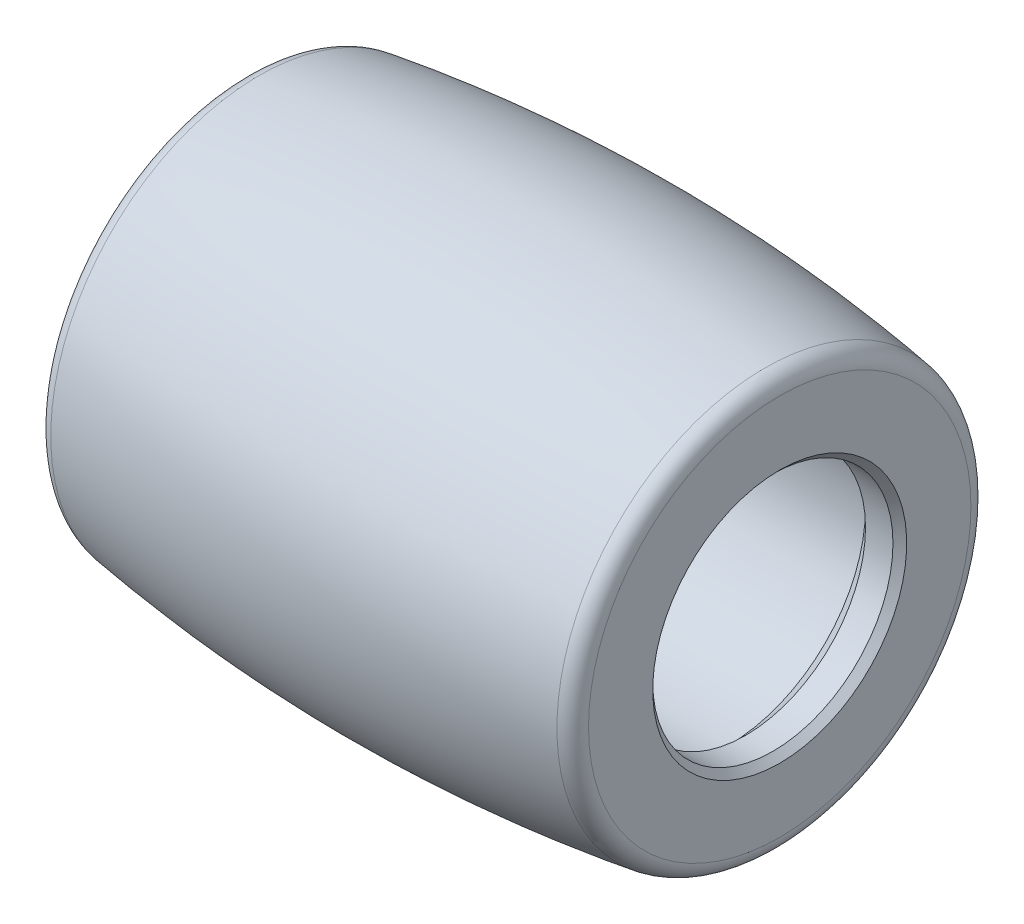
ISO-10303-21;
HEADER;
FILE_DESCRIPTION(('STEP AP214'),'2;1');
FILE_NAME('part.step','',(''),(''),'','','');
FILE_SCHEMA(('AUTOMOTIVE_DESIGN { 1 0 10303 214 1 1 1 1 }'));
ENDSEC;
DATA;
#1=APPLICATION_CONTEXT('core data for automotive mechanical design processes');
#2=APPLICATION_PROTOCOL_DEFINITION('international standard','automotive_design',2000,#1);
#3=PRODUCT_CONTEXT('',#1,'mechanical');
#4=PRODUCT('Part','Part','',(#3));
#5=PRODUCT_RELATED_PRODUCT_CATEGORY('part','',(#4));
#6=PRODUCT_DEFINITION_FORMATION('','',#4);
#7=PRODUCT_DEFINITION_CONTEXT('part definition',#1,'design');
#8=PRODUCT_DEFINITION('design','',#6,#7);
#9=PRODUCT_DEFINITION_SHAPE('','',#8);
#10=(LENGTH_UNIT() NAMED_UNIT(*) SI_UNIT(.MILLI.,.METRE.));
#11=(NAMED_UNIT(*) PLANE_ANGLE_UNIT() SI_UNIT($,.RADIAN.));
#12=(NAMED_UNIT(*) SI_UNIT($,.STERADIAN.) SOLID_ANGLE_UNIT());
#13=UNCERTAINTY_MEASURE_WITH_UNIT(LENGTH_MEASURE(1.E-05),#10,'distance_accuracy_value','');
#14=(GEOMETRIC_REPRESENTATION_CONTEXT(3) GLOBAL_UNCERTAINTY_ASSIGNED_CONTEXT((#13)) GLOBAL_UNIT_ASSIGNED_CONTEXT((#10,
#11,#12)) REPRESENTATION_CONTEXT('',''));
#15=CARTESIAN_POINT('',(0.,0.,0.));
#16=DIRECTION('',(0.,0.,1.));
#17=DIRECTION('',(1.,0.,0.));
#18=AXIS2_PLACEMENT_3D('',#15,#16,#17);
#19=CARTESIAN_POINT('',(-7.8,0.,0.));
#20=DIRECTION('',(-1.,0.,0.));
#21=DIRECTION('',(0.,0.,1.));
#22=AXIS2_PLACEMENT_3D('',#19,#20,#21);
#23=CYLINDRICAL_SURFACE('',#22,4.);
#24=CARTESIAN_POINT('',(-6.30000000012387,0.,0.));
#25=DIRECTION('',(1.,0.,0.));
#26=DIRECTION('',(0.,0.,-1.));
#27=AXIS2_PLACEMENT_3D('',#24,#25,#26);
#28=CIRCLE('',#27,3.99999999996226);
#29=CARTESIAN_POINT('',(-6.30000000012387,0.,-3.99999999996226));
#30=VERTEX_POINT('',#29);
#31=EDGE_CURVE('E47',#30,#30,#28,.F.);
#32=ORIENTED_EDGE('',*,*,#31,.T.);
#33=EDGE_LOOP('',(#32));
#34=FACE_BOUND('',#33,.T.);
#35=CARTESIAN_POINT('',(6.30000000012387,0.,0.));
#36=DIRECTION('',(-1.,0.,0.));
#37=DIRECTION('',(0.,0.,1.));
#38=AXIS2_PLACEMENT_3D('',#35,#36,#37);
#39=CIRCLE('',#38,3.99999999996226);
#40=CARTESIAN_POINT('',(6.30000000012387,0.,3.99999999996226));
#41=VERTEX_POINT('',#40);
#42=EDGE_CURVE('E70',#41,#41,#39,.F.);
#43=ORIENTED_EDGE('',*,*,#42,.T.);
#44=EDGE_LOOP('',(#43));
#45=FACE_BOUND('',#44,.T.);
#46=ADVANCED_FACE('F16',(#34,#45),#23,.F.);
#47=CARTESIAN_POINT('',(-6.30000000023756,0.,0.));
#48=DIRECTION('',(1.,0.,0.));
#49=DIRECTION('',(0.,0.,-1.));
#50=AXIS2_PLACEMENT_3D('',#47,#48,#49);
#51=CONICAL_SURFACE('',#50,3.99999999984857,0.785398163397448);
#52=CARTESIAN_POINT('',(-6.8,0.,0.));
#53=DIRECTION('',(1.,0.,0.));
#54=DIRECTION('',(0.,0.,-1.));
#55=AXIS2_PLACEMENT_3D('',#52,#53,#54);
#56=CIRCLE('',#55,3.5);
#57=CARTESIAN_POINT('',(-6.8,0.,-3.5));
#58=VERTEX_POINT('',#57);
#59=EDGE_CURVE('E68',#58,#58,#56,.F.);
#60=ORIENTED_EDGE('',*,*,#59,.T.);
#61=EDGE_LOOP('',(#60));
#62=FACE_BOUND('',#61,.T.);
#63=ORIENTED_EDGE('',*,*,#31,.F.);
#64=EDGE_LOOP('',(#63));
#65=FACE_BOUND('',#64,.T.);
#66=ADVANCED_FACE('F78',(#62,#65),#51,.F.);
#67=CARTESIAN_POINT('',(6.30000000023756,0.,0.));
#68=DIRECTION('',(-1.,0.,0.));
#69=DIRECTION('',(0.,0.,1.));
#70=AXIS2_PLACEMENT_3D('',#67,#68,#69);
#71=CONICAL_SURFACE('',#70,3.99999999984857,0.785398163397448);
#72=ORIENTED_EDGE('',*,*,#42,.F.);
#73=EDGE_LOOP('',(#72));
#74=FACE_BOUND('',#73,.T.);
#75=CARTESIAN_POINT('',(6.8,0.,0.));
#76=DIRECTION('',(1.,0.,0.));
#77=DIRECTION('',(0.,0.,-1.));
#78=AXIS2_PLACEMENT_3D('',#75,#76,#77);
#79=CIRCLE('',#78,3.5);
#80=CARTESIAN_POINT('',(6.8,0.,-3.5));
#81=VERTEX_POINT('',#80);
#82=EDGE_CURVE('E61',#81,#81,#79,.T.);
#83=ORIENTED_EDGE('',*,*,#82,.T.);
#84=EDGE_LOOP('',(#83));
#85=FACE_BOUND('',#84,.T.);
#86=ADVANCED_FACE('F80',(#74,#85),#71,.F.);
#87=CARTESIAN_POINT('',(-7.8,0.,0.));
#88=DIRECTION('',(1.,0.,0.));
#89=DIRECTION('',(0.,0.,-1.));
#90=AXIS2_PLACEMENT_3D('',#87,#88,#89);
#91=CYLINDRICAL_SURFACE('',#90,3.5);
#92=CARTESIAN_POINT('',(-7.60000000002492,0.,0.));
#93=DIRECTION('',(-1.,0.,0.));
#94=DIRECTION('',(0.,-1.,0.));
#95=AXIS2_PLACEMENT_3D('',#92,#93,#94);
#96=CIRCLE('',#95,3.49999999997408);
#97=CARTESIAN_POINT('',(-7.60000000002492,-3.49999999997408,0.));
#98=VERTEX_POINT('',#97);
#99=EDGE_CURVE('E56',#98,#98,#96,.T.);
#100=ORIENTED_EDGE('',*,*,#99,.T.);
#101=EDGE_LOOP('',(#100));
#102=FACE_BOUND('',#101,.T.);
#103=ORIENTED_EDGE('',*,*,#59,.F.);
#104=EDGE_LOOP('',(#103));
#105=FACE_BOUND('',#104,.T.);
#106=ADVANCED_FACE('F88',(#102,#105),#91,.F.);
#107=CARTESIAN_POINT('',(7.8,0.,0.));
#108=DIRECTION('',(1.,0.,0.));
#109=DIRECTION('',(0.,0.,-1.));
#110=AXIS2_PLACEMENT_3D('',#107,#108,#109);
#111=CYLINDRICAL_SURFACE('',#110,3.5);
#112=CARTESIAN_POINT('',(7.60000000008176,0.,0.));
#113=DIRECTION('',(1.,0.,0.));
#114=DIRECTION('',(0.,1.,0.));
#115=AXIS2_PLACEMENT_3D('',#112,#113,#114);
#116=CIRCLE('',#115,3.49999999997408);
#117=CARTESIAN_POINT('',(7.60000000008176,3.49999999997408,0.));
#118=VERTEX_POINT('',#117);
#119=EDGE_CURVE('E52',#118,#118,#116,.T.);
#120=ORIENTED_EDGE('',*,*,#119,.T.);
#121=EDGE_LOOP('',(#120));
#122=FACE_BOUND('',#121,.T.);
#123=ORIENTED_EDGE('',*,*,#82,.F.);
#124=EDGE_LOOP('',(#123));
#125=FACE_BOUND('',#124,.T.);
#126=ADVANCED_FACE('F119',(#122,#125),#111,.F.);
#127=CARTESIAN_POINT('',(-7.79999999997472,0.,0.));
#128=DIRECTION('',(-1.,0.,0.));
#129=DIRECTION('',(0.,0.,1.));
#130=AXIS2_PLACEMENT_3D('',#127,#128,#129);
#131=CONICAL_SURFACE('',#130,3.69999999992388,0.785398163397446);
#132=ORIENTED_EDGE('',*,*,#99,.F.);
#133=EDGE_LOOP('',(#132));
#134=FACE_BOUND('',#133,.T.);
#135=CARTESIAN_POINT('',(-7.79999999997472,0.,0.));
#136=DIRECTION('',(-1.,0.,0.));
#137=DIRECTION('',(0.,0.,1.));
#138=AXIS2_PLACEMENT_3D('',#135,#136,#137);
#139=CIRCLE('',#138,3.69999999992387);
#140=CARTESIAN_POINT('',(-7.79999999997472,0.,3.69999999992387));
#141=VERTEX_POINT('',#140);
#142=EDGE_CURVE('E20',#141,#141,#139,.T.);
#143=ORIENTED_EDGE('',*,*,#142,.T.);
#144=EDGE_LOOP('',(#143));
#145=FACE_BOUND('',#144,.T.);
#146=ADVANCED_FACE('F115',(#134,#145),#131,.F.);
#147=CARTESIAN_POINT('',(7.80000000003156,0.,0.));
#148=DIRECTION('',(1.,0.,0.));
#149=DIRECTION('',(0.,1.,0.));
#150=AXIS2_PLACEMENT_3D('',#147,#148,#149);
#151=CONICAL_SURFACE('',#150,3.69999999992388,0.78539816325534);
#152=ORIENTED_EDGE('',*,*,#119,.F.);
#153=EDGE_LOOP('',(#152));
#154=FACE_BOUND('',#153,.T.);
#155=CARTESIAN_POINT('',(7.80000000003156,0.,0.));
#156=DIRECTION('',(1.,0.,0.));
#157=DIRECTION('',(0.,1.,0.));
#158=AXIS2_PLACEMENT_3D('',#155,#156,#157);
#159=CIRCLE('',#158,3.69999999992388);
#160=CARTESIAN_POINT('',(7.80000000003156,3.69999999992388,0.));
#161=VERTEX_POINT('',#160);
#162=EDGE_CURVE('E37',#161,#161,#159,.F.);
#163=ORIENTED_EDGE('',*,*,#162,.F.);
#164=EDGE_LOOP('',(#163));
#165=FACE_BOUND('',#164,.T.);
#166=ADVANCED_FACE('F111',(#154,#165),#151,.F.);
#167=CARTESIAN_POINT('',(-7.8,0.,0.));
#168=DIRECTION('',(1.,0.,0.));
#169=DIRECTION('',(0.,0.,-1.));
#170=AXIS2_PLACEMENT_3D('',#167,#168,#169);
#171=PLANE('',#170);
#172=CARTESIAN_POINT('',(-7.79999999999784,-3.83374516150605E-13,2.18278986125421E-11));
#173=DIRECTION('',(1.,0.,0.));
#174=DIRECTION('',(0.,0.,-1.));
#175=AXIS2_PLACEMENT_3D('',#172,#173,#174);
#176=CIRCLE('',#175,5.57090392677671);
#177=CARTESIAN_POINT('',(-7.79999999999784,-3.83374516150605E-13,-5.57090392675488));
#178=VERTEX_POINT('',#177);
#179=EDGE_CURVE('E36',#178,#178,#176,.T.);
#180=ORIENTED_EDGE('',*,*,#179,.F.);
#181=EDGE_LOOP('',(#180));
#182=FACE_BOUND('',#181,.T.);
#183=ORIENTED_EDGE('',*,*,#142,.F.);
#184=EDGE_LOOP('',(#183));
#185=FACE_BOUND('',#184,.T.);
#186=ADVANCED_FACE('F108',(#182,#185),#171,.F.);
#187=CARTESIAN_POINT('',(7.8,0.,0.));
#188=DIRECTION('',(1.,0.,0.));
#189=DIRECTION('',(0.,0.,-1.));
#190=AXIS2_PLACEMENT_3D('',#187,#188,#189);
#191=PLANE('',#190);
#192=CARTESIAN_POINT('',(7.79999999999999,0.,-1.66946805772034E-12));
#193=DIRECTION('',(1.,0.,0.));
#194=DIRECTION('',(0.,0.,-1.));
#195=AXIS2_PLACEMENT_3D('',#192,#193,#194);
#196=CIRCLE('',#195,5.57090531712202);
#197=CARTESIAN_POINT('',(7.79999999999999,-5.570905317122,-2.90671959700568E-11));
#198=VERTEX_POINT('',#197);
#199=CARTESIAN_POINT('',(7.8,-5.57051079473146,-0.0662360651946447));
#200=VERTEX_POINT('',#199);
#201=EDGE_CURVE('E32',#198,#200,#196,.F.);
#202=ORIENTED_EDGE('',*,*,#201,.F.);
#203=DIRECTION('',(0.,0.00596807812759522,-0.999982190863149));
#204=VECTOR('',#203,1.);
#205=CARTESIAN_POINT('',(7.8,-5.570905317122,-2.90237152677025E-11));
#206=LINE('',#205,#204);
#207=EDGE_CURVE('E34',#198,#200,#206,.T.);
#208=ORIENTED_EDGE('',*,*,#207,.T.);
#209=EDGE_LOOP('',(#202,#208));
#210=FACE_BOUND('',#209,.T.);
#211=ORIENTED_EDGE('',*,*,#162,.T.);
#212=EDGE_LOOP('',(#211));
#213=FACE_BOUND('',#212,.T.);
#214=ADVANCED_FACE('F39',(#210,#213),#191,.T.);
#215=CARTESIAN_POINT('',(-7.29999999999999,-3.83373888190874E-13,2.18278628678903E-11));
#216=DIRECTION('',(1.,0.,0.));
#217=DIRECTION('',(0.,0.,-1.));
#218=AXIS2_PLACEMENT_3D('',#215,#216,#217);
#219=TOROIDAL_SURFACE('',#218,5.57090539665,0.500000000000005);
#220=CARTESIAN_POINT('',(-7.37373740775296,0.,-1.35308431126191E-13));
#221=DIRECTION('',(1.,0.,0.));
#222=DIRECTION('',(0.,0.,-1.));
#223=AXIS2_PLACEMENT_3D('',#220,#221,#222);
#224=CIRCLE('',#223,6.06543830222605);
#225=CARTESIAN_POINT('',(-7.37373740775296,0.,-6.06543830222618));
#226=VERTEX_POINT('',#225);
#227=EDGE_CURVE('E25',#226,#226,#224,.T.);
#228=ORIENTED_EDGE('',*,*,#227,.F.);
#229=EDGE_LOOP('',(#228));
#230=FACE_BOUND('',#229,.T.);
#231=ORIENTED_EDGE('',*,*,#179,.T.);
#232=EDGE_LOOP('',(#231));
#233=FACE_BOUND('',#232,.T.);
#234=ADVANCED_FACE('F100',(#230,#233),#219,.T.);
#235=CARTESIAN_POINT('',(7.3,0.,-1.66946805772034E-12));
#236=DIRECTION('',(1.,0.,0.));
#237=DIRECTION('',(0.,0.,-1.));
#238=AXIS2_PLACEMENT_3D('',#235,#236,#237);
#239=TOROIDAL_SURFACE('',#238,5.57090539665,0.500000000000003);
#240=CARTESIAN_POINT('',(7.37373739217235,0.,-1.35308431126191E-13));
#241=DIRECTION('',(1.,0.,0.));
#242=DIRECTION('',(0.,0.,-1.));
#243=AXIS2_PLACEMENT_3D('',#240,#241,#242);
#244=CIRCLE('',#243,6.06543830454967);
#245=CARTESIAN_POINT('',(7.37373739217235,0.,-6.0654383045498));
#246=VERTEX_POINT('',#245);
#247=EDGE_CURVE('E11',#246,#246,#244,.F.);
#248=ORIENTED_EDGE('',*,*,#247,.F.);
#249=EDGE_LOOP('',(#248));
#250=FACE_BOUND('',#249,.T.);
#251=ORIENTED_EDGE('',*,*,#201,.T.);
#252=ORIENTED_EDGE('',*,*,#207,.F.);
#253=EDGE_LOOP('',(#251,#252));
#254=FACE_BOUND('',#253,.T.);
#255=ADVANCED_FACE('F18',(#250,#254),#239,.T.);
#256=CARTESIAN_POINT('',(1.57903204400789E-12,0.,43.3878527575467));
#257=DIRECTION('',(0.,1.,0.));
#258=DIRECTION('',(0.,0.,-1.));
#259=AXIS2_PLACEMENT_3D('',#256,#257,#258);
#260=CIRCLE('',#259,50.0000000000113);
#261=TRIMMED_CURVE('',#260,(PARAMETER_VALUE(-0.520125015553683)),
(PARAMETER_VALUE(0.520125015553683)),.T.,.PARAMETER.);
#262=CARTESIAN_POINT('',(1.57903204400789E-12,0.,-1.35308431126191E-13));
#263=DIRECTION('',(1.,0.,0.));
#264=AXIS1_PLACEMENT('',#262,#263);
#265=SURFACE_OF_REVOLUTION('',#261,#264);
#266=ORIENTED_EDGE('',*,*,#227,.T.);
#267=EDGE_LOOP('',(#266));
#268=FACE_BOUND('',#267,.T.);
#269=ORIENTED_EDGE('',*,*,#247,.T.);
#270=EDGE_LOOP('',(#269));
#271=FACE_BOUND('',#270,.T.);
#272=ADVANCED_FACE('F93',(#268,#271),#265,.F.);
#273=CLOSED_SHELL('',(#46,#66,#86,#106,#126,#146,#166,#186,#214,#234,#255,#272));
#274=MANIFOLD_SOLID_BREP('B1',#273);
#275=ADVANCED_BREP_SHAPE_REPRESENTATION('',(#18,#274),#14);
#276=SHAPE_DEFINITION_REPRESENTATION(#9,#275);
ENDSEC;
END-ISO-10303-21;
